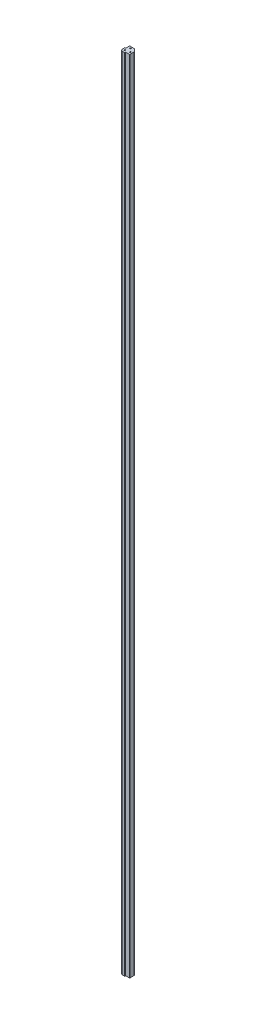
ISO-10303-21;
HEADER;
FILE_DESCRIPTION(('STEP AP214'),'2;1');
FILE_NAME('part.step','',(''),(''),'','','');
FILE_SCHEMA(('AUTOMOTIVE_DESIGN { 1 0 10303 214 1 1 1 1 }'));
ENDSEC;
DATA;
#1=APPLICATION_CONTEXT('core data for automotive mechanical design processes');
#2=APPLICATION_PROTOCOL_DEFINITION('international standard','automotive_design',2000,#1);
#3=PRODUCT_CONTEXT('',#1,'mechanical');
#4=PRODUCT('Part','Part','',(#3));
#5=PRODUCT_RELATED_PRODUCT_CATEGORY('part','',(#4));
#6=PRODUCT_DEFINITION_FORMATION('','',#4);
#7=PRODUCT_DEFINITION_CONTEXT('part definition',#1,'design');
#8=PRODUCT_DEFINITION('design','',#6,#7);
#9=PRODUCT_DEFINITION_SHAPE('','',#8);
#10=(LENGTH_UNIT() NAMED_UNIT(*) SI_UNIT(.MILLI.,.METRE.));
#11=(NAMED_UNIT(*) PLANE_ANGLE_UNIT() SI_UNIT($,.RADIAN.));
#12=(NAMED_UNIT(*) SI_UNIT($,.STERADIAN.) SOLID_ANGLE_UNIT());
#13=UNCERTAINTY_MEASURE_WITH_UNIT(LENGTH_MEASURE(1.E-05),#10,'distance_accuracy_value','');
#14=(GEOMETRIC_REPRESENTATION_CONTEXT(3) GLOBAL_UNCERTAINTY_ASSIGNED_CONTEXT((#13)) GLOBAL_UNIT_ASSIGNED_CONTEXT((#10,
#11,#12)) REPRESENTATION_CONTEXT('',''));
#15=CARTESIAN_POINT('',(0.,0.,0.));
#16=DIRECTION('',(0.,0.,1.));
#17=DIRECTION('',(1.,0.,0.));
#18=AXIS2_PLACEMENT_3D('',#15,#16,#17);
#19=CARTESIAN_POINT('',(4.57199999999998,1828.8,4.826));
#20=DIRECTION('',(0.,-1.,0.));
#21=DIRECTION('',(0.,0.,-1.));
#22=AXIS2_PLACEMENT_3D('',#19,#20,#21);
#23=CYLINDRICAL_SURFACE('',#22,0.254000000000002);
#24=CARTESIAN_POINT('',(4.57199999999998,0.,4.826));
#25=DIRECTION('',(0.,1.,0.));
#26=DIRECTION('',(0.,0.,-1.));
#27=AXIS2_PLACEMENT_3D('',#24,#25,#26);
#28=CIRCLE('',#27,0.254000000000002);
#29=CARTESIAN_POINT('',(4.57199999999998,0.,5.08));
#30=VERTEX_POINT('',#29);
#31=CARTESIAN_POINT('',(4.82599999999998,0.,4.826));
#32=VERTEX_POINT('',#31);
#33=EDGE_CURVE('E190',#30,#32,#28,.T.);
#34=ORIENTED_EDGE('',*,*,#33,.T.);
#35=DIRECTION('',(0.,-1.,0.));
#36=VECTOR('',#35,1.);
#37=CARTESIAN_POINT('',(4.82599999999998,1828.8,4.826));
#38=LINE('',#37,#36);
#39=CARTESIAN_POINT('',(4.82599999999998,1828.8,4.826));
#40=VERTEX_POINT('',#39);
#41=EDGE_CURVE('E11',#40,#32,#38,.T.);
#42=ORIENTED_EDGE('',*,*,#41,.F.);
#43=CARTESIAN_POINT('',(4.57199999999998,1828.8,4.826));
#44=DIRECTION('',(0.,1.,0.));
#45=DIRECTION('',(0.,0.,-1.));
#46=AXIS2_PLACEMENT_3D('',#43,#44,#45);
#47=CIRCLE('',#46,0.254000000000002);
#48=CARTESIAN_POINT('',(4.57199999999998,1828.8,5.08));
#49=VERTEX_POINT('',#48);
#50=EDGE_CURVE('E225',#49,#40,#47,.T.);
#51=ORIENTED_EDGE('',*,*,#50,.F.);
#52=DIRECTION('',(0.,-1.,0.));
#53=VECTOR('',#52,1.);
#54=CARTESIAN_POINT('',(4.57199999999998,1828.8,5.08));
#55=LINE('',#54,#53);
#56=EDGE_CURVE('E186',#49,#30,#55,.T.);
#57=ORIENTED_EDGE('',*,*,#56,.T.);
#58=EDGE_LOOP('',(#34,#42,#51,#57));
#59=FACE_BOUND('',#58,.T.);
#60=ADVANCED_FACE('F34',(#59),#23,.T.);
#61=CARTESIAN_POINT('',(4.82599999999998,1828.8,3.175));
#62=DIRECTION('',(-1.,0.,0.));
#63=DIRECTION('',(0.,0.,1.));
#64=AXIS2_PLACEMENT_3D('',#61,#62,#63);
#65=PLANE('',#64);
#66=DIRECTION('',(0.,0.,-1.));
#67=VECTOR('',#66,1.);
#68=CARTESIAN_POINT('',(4.82599999999998,0.,3.175));
#69=LINE('',#68,#67);
#70=CARTESIAN_POINT('',(4.82599999999998,0.,3.175));
#71=VERTEX_POINT('',#70);
#72=EDGE_CURVE('E193',#32,#71,#69,.T.);
#73=ORIENTED_EDGE('',*,*,#72,.T.);
#74=DIRECTION('',(0.,-1.,0.));
#75=VECTOR('',#74,1.);
#76=CARTESIAN_POINT('',(4.82599999999998,1828.8,3.175));
#77=LINE('',#76,#75);
#78=CARTESIAN_POINT('',(4.82599999999998,1828.8,3.175));
#79=VERTEX_POINT('',#78);
#80=EDGE_CURVE('E42',#79,#71,#77,.T.);
#81=ORIENTED_EDGE('',*,*,#80,.F.);
#82=DIRECTION('',(0.,0.,-1.));
#83=VECTOR('',#82,1.);
#84=CARTESIAN_POINT('',(4.82599999999998,1828.8,3.175));
#85=LINE('',#84,#83);
#86=EDGE_CURVE('E123',#40,#79,#85,.T.);
#87=ORIENTED_EDGE('',*,*,#86,.F.);
#88=ORIENTED_EDGE('',*,*,#41,.T.);
#89=EDGE_LOOP('',(#73,#81,#87,#88));
#90=FACE_BOUND('',#89,.T.);
#91=ADVANCED_FACE('F334',(#90),#65,.F.);
#92=CARTESIAN_POINT('',(4.95299999999998,1828.8,3.175));
#93=DIRECTION('',(0.,-1.,0.));
#94=DIRECTION('',(0.,0.,-1.));
#95=AXIS2_PLACEMENT_3D('',#92,#93,#94);
#96=CYLINDRICAL_SURFACE('',#95,0.127);
#97=CARTESIAN_POINT('',(4.95299999999998,0.,3.175));
#98=DIRECTION('',(0.,-1.,0.));
#99=DIRECTION('',(0.,0.,1.));
#100=AXIS2_PLACEMENT_3D('',#97,#98,#99);
#101=CIRCLE('',#100,0.127);
#102=CARTESIAN_POINT('',(4.95299999999998,0.,3.048));
#103=VERTEX_POINT('',#102);
#104=EDGE_CURVE('E196',#71,#103,#101,.T.);
#105=ORIENTED_EDGE('',*,*,#104,.T.);
#106=DIRECTION('',(0.,-1.,0.));
#107=VECTOR('',#106,1.);
#108=CARTESIAN_POINT('',(4.95299999999998,1828.8,3.048));
#109=LINE('',#108,#107);
#110=CARTESIAN_POINT('',(4.95299999999998,1828.8,3.048));
#111=VERTEX_POINT('',#110);
#112=EDGE_CURVE('E262',#111,#103,#109,.T.);
#113=ORIENTED_EDGE('',*,*,#112,.F.);
#114=CARTESIAN_POINT('',(4.95299999999998,1828.8,3.175));
#115=DIRECTION('',(0.,-1.,0.));
#116=DIRECTION('',(0.,0.,1.));
#117=AXIS2_PLACEMENT_3D('',#114,#115,#116);
#118=CIRCLE('',#117,0.127);
#119=EDGE_CURVE('E270',#79,#111,#118,.T.);
#120=ORIENTED_EDGE('',*,*,#119,.F.);
#121=ORIENTED_EDGE('',*,*,#80,.T.);
#122=EDGE_LOOP('',(#105,#113,#120,#121));
#123=FACE_BOUND('',#122,.T.);
#124=ADVANCED_FACE('F268',(#123),#96,.F.);
#125=CARTESIAN_POINT('',(13.208,1828.8,3.048));
#126=DIRECTION('',(0.,0.,-1.));
#127=DIRECTION('',(-1.,0.,0.));
#128=AXIS2_PLACEMENT_3D('',#125,#126,#127);
#129=PLANE('',#128);
#130=DIRECTION('',(1.,0.,0.));
#131=VECTOR('',#130,1.);
#132=CARTESIAN_POINT('',(13.208,0.,3.048));
#133=LINE('',#132,#131);
#134=CARTESIAN_POINT('',(13.208,0.,3.048));
#135=VERTEX_POINT('',#134);
#136=EDGE_CURVE('E198',#103,#135,#133,.T.);
#137=ORIENTED_EDGE('',*,*,#136,.T.);
#138=DIRECTION('',(0.,-1.,0.));
#139=VECTOR('',#138,1.);
#140=CARTESIAN_POINT('',(13.208,1828.8,3.048));
#141=LINE('',#140,#139);
#142=CARTESIAN_POINT('',(13.208,1828.8,3.048));
#143=VERTEX_POINT('',#142);
#144=EDGE_CURVE('E259',#143,#135,#141,.T.);
#145=ORIENTED_EDGE('',*,*,#144,.F.);
#146=DIRECTION('',(1.,0.,0.));
#147=VECTOR('',#146,1.);
#148=CARTESIAN_POINT('',(13.208,1828.8,3.048));
#149=LINE('',#148,#147);
#150=EDGE_CURVE('E288',#111,#143,#149,.T.);
#151=ORIENTED_EDGE('',*,*,#150,.F.);
#152=ORIENTED_EDGE('',*,*,#112,.T.);
#153=EDGE_LOOP('',(#137,#145,#151,#152));
#154=FACE_BOUND('',#153,.T.);
#155=ADVANCED_FACE('F279',(#154),#129,.F.);
#156=CARTESIAN_POINT('',(13.208,1828.8,2.286));
#157=DIRECTION('',(0.,-1.,0.));
#158=DIRECTION('',(0.,0.,-1.));
#159=AXIS2_PLACEMENT_3D('',#156,#157,#158);
#160=CYLINDRICAL_SURFACE('',#159,0.761999999999999);
#161=CARTESIAN_POINT('',(13.208,0.,2.286));
#162=DIRECTION('',(0.,1.,0.));
#163=DIRECTION('',(0.,0.,1.));
#164=AXIS2_PLACEMENT_3D('',#161,#162,#163);
#165=CIRCLE('',#164,0.761999999999999);
#166=CARTESIAN_POINT('',(13.97,0.,2.286));
#167=VERTEX_POINT('',#166);
#168=EDGE_CURVE('E200',#135,#167,#165,.T.);
#169=ORIENTED_EDGE('',*,*,#168,.T.);
#170=DIRECTION('',(0.,-1.,0.));
#171=VECTOR('',#170,1.);
#172=CARTESIAN_POINT('',(13.97,1828.8,2.286));
#173=LINE('',#172,#171);
#174=CARTESIAN_POINT('',(13.97,1828.8,2.286));
#175=VERTEX_POINT('',#174);
#176=EDGE_CURVE('E256',#175,#167,#173,.T.);
#177=ORIENTED_EDGE('',*,*,#176,.F.);
#178=CARTESIAN_POINT('',(13.208,1828.8,2.286));
#179=DIRECTION('',(0.,1.,0.));
#180=DIRECTION('',(0.,0.,1.));
#181=AXIS2_PLACEMENT_3D('',#178,#179,#180);
#182=CIRCLE('',#181,0.761999999999999);
#183=EDGE_CURVE('E285',#143,#175,#182,.T.);
#184=ORIENTED_EDGE('',*,*,#183,.F.);
#185=ORIENTED_EDGE('',*,*,#144,.T.);
#186=EDGE_LOOP('',(#169,#177,#184,#185));
#187=FACE_BOUND('',#186,.T.);
#188=ADVANCED_FACE('F283',(#187),#160,.T.);
#189=CARTESIAN_POINT('',(13.97,1828.8,2.286));
#190=DIRECTION('',(-1.,0.,0.));
#191=DIRECTION('',(0.,0.,1.));
#192=AXIS2_PLACEMENT_3D('',#189,#190,#191);
#193=PLANE('',#192);
#194=DIRECTION('',(0.,0.,-1.));
#195=VECTOR('',#194,1.);
#196=CARTESIAN_POINT('',(13.97,0.,2.286));
#197=LINE('',#196,#195);
#198=CARTESIAN_POINT('',(13.97,0.,-7.30436926547168));
#199=VERTEX_POINT('',#198);
#200=EDGE_CURVE('E202',#167,#199,#197,.T.);
#201=ORIENTED_EDGE('',*,*,#200,.T.);
#202=DIRECTION('',(0.,-1.,0.));
#203=VECTOR('',#202,1.);
#204=CARTESIAN_POINT('',(13.97,1828.8,-7.30436926547168));
#205=LINE('',#204,#203);
#206=CARTESIAN_POINT('',(13.97,1828.8,-7.30436926547168));
#207=VERTEX_POINT('',#206);
#208=EDGE_CURVE('E253',#207,#199,#205,.T.);
#209=ORIENTED_EDGE('',*,*,#208,.F.);
#210=DIRECTION('',(0.,0.,-1.));
#211=VECTOR('',#210,1.);
#212=CARTESIAN_POINT('',(13.97,1828.8,2.286));
#213=LINE('',#212,#211);
#214=EDGE_CURVE('E287',#175,#207,#213,.T.);
#215=ORIENTED_EDGE('',*,*,#214,.F.);
#216=ORIENTED_EDGE('',*,*,#176,.T.);
#217=EDGE_LOOP('',(#201,#209,#215,#216));
#218=FACE_BOUND('',#217,.T.);
#219=ADVANCED_FACE('F347',(#218),#193,.F.);
#220=CARTESIAN_POINT('',(13.208,1828.8,-7.30436926547168));
#221=DIRECTION('',(0.,-1.,0.));
#222=DIRECTION('',(0.,0.,-1.));
#223=AXIS2_PLACEMENT_3D('',#220,#221,#222);
#224=CYLINDRICAL_SURFACE('',#223,0.761999999999999);
#225=CARTESIAN_POINT('',(13.208,0.,-7.30436926547168));
#226=DIRECTION('',(0.,1.,0.));
#227=DIRECTION('',(0.,0.,-1.));
#228=AXIS2_PLACEMENT_3D('',#225,#226,#227);
#229=CIRCLE('',#228,0.761999999999999);
#230=CARTESIAN_POINT('',(13.7468153672641,0.,-7.84318463273583));
#231=VERTEX_POINT('',#230);
#232=EDGE_CURVE('E204',#199,#231,#229,.T.);
#233=ORIENTED_EDGE('',*,*,#232,.T.);
#234=DIRECTION('',(0.,-1.,0.));
#235=VECTOR('',#234,1.);
#236=CARTESIAN_POINT('',(13.7468153672641,1828.8,-7.84318463273583));
#237=LINE('',#236,#235);
#238=CARTESIAN_POINT('',(13.7468153672641,1828.8,-7.84318463273583));
#239=VERTEX_POINT('',#238);
#240=EDGE_CURVE('E250',#239,#231,#237,.T.);
#241=ORIENTED_EDGE('',*,*,#240,.F.);
#242=CARTESIAN_POINT('',(13.208,1828.8,-7.30436926547168));
#243=DIRECTION('',(0.,1.,0.));
#244=DIRECTION('',(0.,0.,-1.));
#245=AXIS2_PLACEMENT_3D('',#242,#243,#244);
#246=CIRCLE('',#245,0.761999999999999);
#247=EDGE_CURVE('E290',#207,#239,#246,.T.);
#248=ORIENTED_EDGE('',*,*,#247,.F.);
#249=ORIENTED_EDGE('',*,*,#208,.T.);
#250=EDGE_LOOP('',(#233,#241,#248,#249));
#251=FACE_BOUND('',#250,.T.);
#252=ADVANCED_FACE('F350',(#251),#224,.T.);
#253=CARTESIAN_POINT('',(7.84318463273583,1828.8,-13.7468153672641));
#254=DIRECTION('',(-0.707106781186549,0.,0.707106781186546));
#255=DIRECTION('',(0.707106781186546,0.,0.707106781186549));
#256=AXIS2_PLACEMENT_3D('',#253,#254,#255);
#257=PLANE('',#256);
#258=DIRECTION('',(-0.707106781186546,0.,-0.707106781186549));
#259=VECTOR('',#258,1.);
#260=CARTESIAN_POINT('',(7.84318463273583,0.,-13.7468153672641));
#261=LINE('',#260,#259);
#262=CARTESIAN_POINT('',(7.84318463273583,0.,-13.7468153672641));
#263=VERTEX_POINT('',#262);
#264=EDGE_CURVE('E206',#231,#263,#261,.T.);
#265=ORIENTED_EDGE('',*,*,#264,.T.);
#266=DIRECTION('',(0.,-1.,0.));
#267=VECTOR('',#266,1.);
#268=CARTESIAN_POINT('',(7.84318463273583,1828.8,-13.7468153672641));
#269=LINE('',#268,#267);
#270=CARTESIAN_POINT('',(7.84318463273583,1828.8,-13.7468153672641));
#271=VERTEX_POINT('',#270);
#272=EDGE_CURVE('E247',#271,#263,#269,.T.);
#273=ORIENTED_EDGE('',*,*,#272,.F.);
#274=DIRECTION('',(-0.707106781186546,0.,-0.707106781186549));
#275=VECTOR('',#274,1.);
#276=CARTESIAN_POINT('',(7.84318463273583,1828.8,-13.7468153672641));
#277=LINE('',#276,#275);
#278=EDGE_CURVE('E296',#239,#271,#277,.T.);
#279=ORIENTED_EDGE('',*,*,#278,.F.);
#280=ORIENTED_EDGE('',*,*,#240,.T.);
#281=EDGE_LOOP('',(#265,#273,#279,#280));
#282=FACE_BOUND('',#281,.T.);
#283=ADVANCED_FACE('F354',(#282),#257,.F.);
#284=CARTESIAN_POINT('',(7.30436926547168,1828.8,-13.208));
#285=DIRECTION('',(0.,-1.,0.));
#286=DIRECTION('',(0.,0.,-1.));
#287=AXIS2_PLACEMENT_3D('',#284,#285,#286);
#288=CYLINDRICAL_SURFACE('',#287,0.761999999999999);
#289=CARTESIAN_POINT('',(7.30436926547168,0.,-13.208));
#290=DIRECTION('',(0.,1.,0.));
#291=DIRECTION('',(0.,0.,1.));
#292=AXIS2_PLACEMENT_3D('',#289,#290,#291);
#293=CIRCLE('',#292,0.761999999999999);
#294=CARTESIAN_POINT('',(7.30436926547168,0.,-13.97));
#295=VERTEX_POINT('',#294);
#296=EDGE_CURVE('E208',#263,#295,#293,.T.);
#297=ORIENTED_EDGE('',*,*,#296,.T.);
#298=DIRECTION('',(0.,-1.,0.));
#299=VECTOR('',#298,1.);
#300=CARTESIAN_POINT('',(7.30436926547168,1828.8,-13.97));
#301=LINE('',#300,#299);
#302=CARTESIAN_POINT('',(7.30436926547168,1828.8,-13.97));
#303=VERTEX_POINT('',#302);
#304=EDGE_CURVE('E244',#303,#295,#301,.T.);
#305=ORIENTED_EDGE('',*,*,#304,.F.);
#306=CARTESIAN_POINT('',(7.30436926547168,1828.8,-13.208));
#307=DIRECTION('',(0.,1.,0.));
#308=DIRECTION('',(0.,0.,1.));
#309=AXIS2_PLACEMENT_3D('',#306,#307,#308);
#310=CIRCLE('',#309,0.761999999999999);
#311=EDGE_CURVE('E298',#271,#303,#310,.T.);
#312=ORIENTED_EDGE('',*,*,#311,.F.);
#313=ORIENTED_EDGE('',*,*,#272,.T.);
#314=EDGE_LOOP('',(#297,#305,#312,#313));
#315=FACE_BOUND('',#314,.T.);
#316=ADVANCED_FACE('F358',(#315),#288,.T.);
#317=CARTESIAN_POINT('',(-2.286,1828.8,-13.97));
#318=DIRECTION('',(0.,0.,1.));
#319=DIRECTION('',(1.,0.,0.));
#320=AXIS2_PLACEMENT_3D('',#317,#318,#319);
#321=PLANE('',#320);
#322=DIRECTION('',(-1.,0.,0.));
#323=VECTOR('',#322,1.);
#324=CARTESIAN_POINT('',(-2.286,0.,-13.97));
#325=LINE('',#324,#323);
#326=CARTESIAN_POINT('',(-2.286,0.,-13.97));
#327=VERTEX_POINT('',#326);
#328=EDGE_CURVE('E210',#295,#327,#325,.T.);
#329=ORIENTED_EDGE('',*,*,#328,.T.);
#330=DIRECTION('',(0.,-1.,0.));
#331=VECTOR('',#330,1.);
#332=CARTESIAN_POINT('',(-2.286,1828.8,-13.97));
#333=LINE('',#332,#331);
#334=CARTESIAN_POINT('',(-2.286,1828.8,-13.97));
#335=VERTEX_POINT('',#334);
#336=EDGE_CURVE('E241',#335,#327,#333,.T.);
#337=ORIENTED_EDGE('',*,*,#336,.F.);
#338=DIRECTION('',(-1.,0.,0.));
#339=VECTOR('',#338,1.);
#340=CARTESIAN_POINT('',(-2.286,1828.8,-13.97));
#341=LINE('',#340,#339);
#342=EDGE_CURVE('E300',#303,#335,#341,.T.);
#343=ORIENTED_EDGE('',*,*,#342,.F.);
#344=ORIENTED_EDGE('',*,*,#304,.T.);
#345=EDGE_LOOP('',(#329,#337,#343,#344));
#346=FACE_BOUND('',#345,.T.);
#347=ADVANCED_FACE('F362',(#346),#321,.F.);
#348=CARTESIAN_POINT('',(-2.286,1828.8,-13.208));
#349=DIRECTION('',(0.,-1.,0.));
#350=DIRECTION('',(0.,0.,-1.));
#351=AXIS2_PLACEMENT_3D('',#348,#349,#350);
#352=CYLINDRICAL_SURFACE('',#351,0.761999999999999);
#353=CARTESIAN_POINT('',(-2.286,0.,-13.208));
#354=DIRECTION('',(0.,1.,0.));
#355=DIRECTION('',(0.,0.,-1.));
#356=AXIS2_PLACEMENT_3D('',#353,#354,#355);
#357=CIRCLE('',#356,0.761999999999999);
#358=CARTESIAN_POINT('',(-3.048,0.,-13.208));
#359=VERTEX_POINT('',#358);
#360=EDGE_CURVE('E212',#327,#359,#357,.T.);
#361=ORIENTED_EDGE('',*,*,#360,.T.);
#362=DIRECTION('',(0.,-1.,0.));
#363=VECTOR('',#362,1.);
#364=CARTESIAN_POINT('',(-3.048,1828.8,-13.208));
#365=LINE('',#364,#363);
#366=CARTESIAN_POINT('',(-3.048,1828.8,-13.208));
#367=VERTEX_POINT('',#366);
#368=EDGE_CURVE('E238',#367,#359,#365,.T.);
#369=ORIENTED_EDGE('',*,*,#368,.F.);
#370=CARTESIAN_POINT('',(-2.286,1828.8,-13.208));
#371=DIRECTION('',(0.,1.,0.));
#372=DIRECTION('',(0.,0.,-1.));
#373=AXIS2_PLACEMENT_3D('',#370,#371,#372);
#374=CIRCLE('',#373,0.761999999999999);
#375=EDGE_CURVE('E302',#335,#367,#374,.T.);
#376=ORIENTED_EDGE('',*,*,#375,.F.);
#377=ORIENTED_EDGE('',*,*,#336,.T.);
#378=EDGE_LOOP('',(#361,#369,#376,#377));
#379=FACE_BOUND('',#378,.T.);
#380=ADVANCED_FACE('F366',(#379),#352,.T.);
#381=CARTESIAN_POINT('',(-3.048,1828.8,-13.208));
#382=DIRECTION('',(1.,0.,0.));
#383=DIRECTION('',(0.,0.,-1.));
#384=AXIS2_PLACEMENT_3D('',#381,#382,#383);
#385=PLANE('',#384);
#386=DIRECTION('',(0.,0.,1.));
#387=VECTOR('',#386,1.);
#388=CARTESIAN_POINT('',(-3.048,0.,-13.208));
#389=LINE('',#388,#387);
#390=CARTESIAN_POINT('',(-3.048,0.,-4.953));
#391=VERTEX_POINT('',#390);
#392=EDGE_CURVE('E214',#359,#391,#389,.T.);
#393=ORIENTED_EDGE('',*,*,#392,.T.);
#394=DIRECTION('',(0.,-1.,0.));
#395=VECTOR('',#394,1.);
#396=CARTESIAN_POINT('',(-3.048,1828.8,-4.953));
#397=LINE('',#396,#395);
#398=CARTESIAN_POINT('',(-3.048,1828.8,-4.953));
#399=VERTEX_POINT('',#398);
#400=EDGE_CURVE('E235',#399,#391,#397,.T.);
#401=ORIENTED_EDGE('',*,*,#400,.F.);
#402=DIRECTION('',(0.,0.,1.));
#403=VECTOR('',#402,1.);
#404=CARTESIAN_POINT('',(-3.048,1828.8,-13.208));
#405=LINE('',#404,#403);
#406=EDGE_CURVE('E304',#367,#399,#405,.T.);
#407=ORIENTED_EDGE('',*,*,#406,.F.);
#408=ORIENTED_EDGE('',*,*,#368,.T.);
#409=EDGE_LOOP('',(#393,#401,#407,#408));
#410=FACE_BOUND('',#409,.T.);
#411=ADVANCED_FACE('F370',(#410),#385,.F.);
#412=CARTESIAN_POINT('',(-3.175,1828.8,-4.953));
#413=DIRECTION('',(0.,-1.,0.));
#414=DIRECTION('',(0.,0.,-1.));
#415=AXIS2_PLACEMENT_3D('',#412,#413,#414);
#416=CYLINDRICAL_SURFACE('',#415,0.127);
#417=CARTESIAN_POINT('',(-3.175,0.,-4.953));
#418=DIRECTION('',(0.,-1.,0.));
#419=DIRECTION('',(0.,0.,-1.));
#420=AXIS2_PLACEMENT_3D('',#417,#418,#419);
#421=CIRCLE('',#420,0.127);
#422=CARTESIAN_POINT('',(-3.175,0.,-4.826));
#423=VERTEX_POINT('',#422);
#424=EDGE_CURVE('E216',#391,#423,#421,.T.);
#425=ORIENTED_EDGE('',*,*,#424,.T.);
#426=DIRECTION('',(0.,-1.,0.));
#427=VECTOR('',#426,1.);
#428=CARTESIAN_POINT('',(-3.175,1828.8,-4.826));
#429=LINE('',#428,#427);
#430=CARTESIAN_POINT('',(-3.175,1828.8,-4.826));
#431=VERTEX_POINT('',#430);
#432=EDGE_CURVE('E232',#431,#423,#429,.T.);
#433=ORIENTED_EDGE('',*,*,#432,.F.);
#434=CARTESIAN_POINT('',(-3.175,1828.8,-4.953));
#435=DIRECTION('',(0.,-1.,0.));
#436=DIRECTION('',(0.,0.,-1.));
#437=AXIS2_PLACEMENT_3D('',#434,#435,#436);
#438=CIRCLE('',#437,0.127);
#439=EDGE_CURVE('E306',#399,#431,#438,.T.);
#440=ORIENTED_EDGE('',*,*,#439,.F.);
#441=ORIENTED_EDGE('',*,*,#400,.T.);
#442=EDGE_LOOP('',(#425,#433,#440,#441));
#443=FACE_BOUND('',#442,.T.);
#444=ADVANCED_FACE('F374',(#443),#416,.F.);
#445=CARTESIAN_POINT('',(-3.175,1828.8,-4.826));
#446=DIRECTION('',(0.,0.,1.));
#447=DIRECTION('',(1.,0.,0.));
#448=AXIS2_PLACEMENT_3D('',#445,#446,#447);
#449=PLANE('',#448);
#450=DIRECTION('',(-1.,0.,0.));
#451=VECTOR('',#450,1.);
#452=CARTESIAN_POINT('',(-3.175,0.,-4.826));
#453=LINE('',#452,#451);
#454=CARTESIAN_POINT('',(-4.826,0.,-4.826));
#455=VERTEX_POINT('',#454);
#456=EDGE_CURVE('E218',#423,#455,#453,.T.);
#457=ORIENTED_EDGE('',*,*,#456,.T.);
#458=DIRECTION('',(0.,-1.,0.));
#459=VECTOR('',#458,1.);
#460=CARTESIAN_POINT('',(-4.826,1828.8,-4.826));
#461=LINE('',#460,#459);
#462=CARTESIAN_POINT('',(-4.826,1828.8,-4.826));
#463=VERTEX_POINT('',#462);
#464=EDGE_CURVE('E229',#463,#455,#461,.T.);
#465=ORIENTED_EDGE('',*,*,#464,.F.);
#466=DIRECTION('',(-1.,0.,0.));
#467=VECTOR('',#466,1.);
#468=CARTESIAN_POINT('',(-3.175,1828.8,-4.826));
#469=LINE('',#468,#467);
#470=EDGE_CURVE('E308',#431,#463,#469,.T.);
#471=ORIENTED_EDGE('',*,*,#470,.F.);
#472=ORIENTED_EDGE('',*,*,#432,.T.);
#473=EDGE_LOOP('',(#457,#465,#471,#472));
#474=FACE_BOUND('',#473,.T.);
#475=ADVANCED_FACE('F314',(#474),#449,.F.);
#476=CARTESIAN_POINT('',(-4.826,1828.8,-4.572));
#477=DIRECTION('',(0.,-1.,0.));
#478=DIRECTION('',(0.,0.,-1.));
#479=AXIS2_PLACEMENT_3D('',#476,#477,#478);
#480=CYLINDRICAL_SURFACE('',#479,0.254);
#481=CARTESIAN_POINT('',(-4.826,0.,-4.572));
#482=DIRECTION('',(0.,1.,0.));
#483=DIRECTION('',(0.,0.,1.));
#484=AXIS2_PLACEMENT_3D('',#481,#482,#483);
#485=CIRCLE('',#484,0.254);
#486=CARTESIAN_POINT('',(-5.08,0.,-4.572));
#487=VERTEX_POINT('',#486);
#488=EDGE_CURVE('E220',#455,#487,#485,.T.);
#489=ORIENTED_EDGE('',*,*,#488,.T.);
#490=DIRECTION('',(0.,-1.,0.));
#491=VECTOR('',#490,1.);
#492=CARTESIAN_POINT('',(-5.08,1828.8,-4.572));
#493=LINE('',#492,#491);
#494=CARTESIAN_POINT('',(-5.08,1828.8,-4.572));
#495=VERTEX_POINT('',#494);
#496=EDGE_CURVE('E181',#495,#487,#493,.T.);
#497=ORIENTED_EDGE('',*,*,#496,.F.);
#498=CARTESIAN_POINT('',(-4.826,1828.8,-4.572));
#499=DIRECTION('',(0.,1.,0.));
#500=DIRECTION('',(0.,0.,1.));
#501=AXIS2_PLACEMENT_3D('',#498,#499,#500);
#502=CIRCLE('',#501,0.254);
#503=EDGE_CURVE('E172',#463,#495,#502,.T.);
#504=ORIENTED_EDGE('',*,*,#503,.F.);
#505=ORIENTED_EDGE('',*,*,#464,.T.);
#506=EDGE_LOOP('',(#489,#497,#504,#505));
#507=FACE_BOUND('',#506,.T.);
#508=ADVANCED_FACE('F318',(#507),#480,.T.);
#509=CARTESIAN_POINT('',(-5.08,1828.8,0.));
#510=DIRECTION('',(1.,0.,0.));
#511=DIRECTION('',(0.,0.,-1.));
#512=AXIS2_PLACEMENT_3D('',#509,#510,#511);
#513=PLANE('',#512);
#514=DIRECTION('',(0.,0.,1.));
#515=VECTOR('',#514,1.);
#516=CARTESIAN_POINT('',(-5.08,0.,0.));
#517=LINE('',#516,#515);
#518=CARTESIAN_POINT('',(-5.08,0.,0.));
#519=VERTEX_POINT('',#518);
#520=EDGE_CURVE('E180',#487,#519,#517,.T.);
#521=ORIENTED_EDGE('',*,*,#520,.T.);
#522=DIRECTION('',(0.,-1.,0.));
#523=VECTOR('',#522,1.);
#524=CARTESIAN_POINT('',(-5.08,1828.8,0.));
#525=LINE('',#524,#523);
#526=CARTESIAN_POINT('',(-5.08,1828.8,0.));
#527=VERTEX_POINT('',#526);
#528=EDGE_CURVE('E177',#527,#519,#525,.T.);
#529=ORIENTED_EDGE('',*,*,#528,.F.);
#530=DIRECTION('',(0.,0.,1.));
#531=VECTOR('',#530,1.);
#532=CARTESIAN_POINT('',(-5.08,1828.8,0.));
#533=LINE('',#532,#531);
#534=EDGE_CURVE('E166',#495,#527,#533,.T.);
#535=ORIENTED_EDGE('',*,*,#534,.F.);
#536=ORIENTED_EDGE('',*,*,#496,.T.);
#537=EDGE_LOOP('',(#521,#529,#535,#536));
#538=FACE_BOUND('',#537,.T.);
#539=ADVANCED_FACE('F178',(#538),#513,.F.);
#540=CARTESIAN_POINT('',(0.,1828.8,0.));
#541=DIRECTION('',(0.,-1.,0.));
#542=DIRECTION('',(0.,0.,-1.));
#543=AXIS2_PLACEMENT_3D('',#540,#541,#542);
#544=CYLINDRICAL_SURFACE('',#543,5.08);
#545=CARTESIAN_POINT('',(0.,0.,0.));
#546=DIRECTION('',(0.,1.,0.));
#547=DIRECTION('',(0.,0.,-1.));
#548=AXIS2_PLACEMENT_3D('',#545,#546,#547);
#549=CIRCLE('',#548,5.08);
#550=CARTESIAN_POINT('',(0.,0.,5.08));
#551=VERTEX_POINT('',#550);
#552=EDGE_CURVE('E109',#519,#551,#549,.T.);
#553=ORIENTED_EDGE('',*,*,#552,.T.);
#554=DIRECTION('',(0.,-1.,0.));
#555=VECTOR('',#554,1.);
#556=CARTESIAN_POINT('',(0.,1828.8,5.08));
#557=LINE('',#556,#555);
#558=CARTESIAN_POINT('',(0.,1828.8,5.08));
#559=VERTEX_POINT('',#558);
#560=EDGE_CURVE('E182',#559,#551,#557,.T.);
#561=ORIENTED_EDGE('',*,*,#560,.F.);
#562=CARTESIAN_POINT('',(0.,1828.8,0.));
#563=DIRECTION('',(0.,1.,0.));
#564=DIRECTION('',(0.,0.,-1.));
#565=AXIS2_PLACEMENT_3D('',#562,#563,#564);
#566=CIRCLE('',#565,5.08);
#567=EDGE_CURVE('E170',#527,#559,#566,.T.);
#568=ORIENTED_EDGE('',*,*,#567,.F.);
#569=ORIENTED_EDGE('',*,*,#528,.T.);
#570=EDGE_LOOP('',(#553,#561,#568,#569));
#571=FACE_BOUND('',#570,.T.);
#572=ADVANCED_FACE('F184',(#571),#544,.T.);
#573=CARTESIAN_POINT('',(0.,1828.8,5.08));
#574=DIRECTION('',(0.,0.,-1.));
#575=DIRECTION('',(-1.,0.,0.));
#576=AXIS2_PLACEMENT_3D('',#573,#574,#575);
#577=PLANE('',#576);
#578=DIRECTION('',(1.,0.,0.));
#579=VECTOR('',#578,1.);
#580=CARTESIAN_POINT('',(0.,0.,5.08));
#581=LINE('',#580,#579);
#582=EDGE_CURVE('E115',#551,#30,#581,.T.);
#583=ORIENTED_EDGE('',*,*,#582,.T.);
#584=ORIENTED_EDGE('',*,*,#56,.F.);
#585=DIRECTION('',(1.,0.,0.));
#586=VECTOR('',#585,1.);
#587=CARTESIAN_POINT('',(0.,1828.8,5.08));
#588=LINE('',#587,#586);
#589=EDGE_CURVE('E50',#559,#49,#588,.T.);
#590=ORIENTED_EDGE('',*,*,#589,.F.);
#591=ORIENTED_EDGE('',*,*,#560,.T.);
#592=EDGE_LOOP('',(#583,#584,#590,#591));
#593=FACE_BOUND('',#592,.T.);
#594=ADVANCED_FACE('F322',(#593),#577,.F.);
#595=CARTESIAN_POINT('',(4.57199999999998,1828.8,4.826));
#596=DIRECTION('',(0.,-1.,0.));
#597=DIRECTION('',(0.,0.,-1.));
#598=AXIS2_PLACEMENT_3D('',#595,#596,#597);
#599=PLANE('',#598);
#600=CARTESIAN_POINT('',(0.,1828.8,0.));
#601=DIRECTION('',(0.,1.,0.));
#602=DIRECTION('',(0.,0.,1.));
#603=AXIS2_PLACEMENT_3D('',#600,#601,#602);
#604=CIRCLE('',#603,1.39699999999977);
#605=CARTESIAN_POINT('',(0.,1828.8,1.39699999999977));
#606=VERTEX_POINT('',#605);
#607=EDGE_CURVE('E450',#606,#606,#604,.T.);
#608=ORIENTED_EDGE('',*,*,#607,.F.);
#609=EDGE_LOOP('',(#608));
#610=FACE_BOUND('',#609,.T.);
#611=CARTESIAN_POINT('',(2.54,1828.8,-10.16));
#612=DIRECTION('',(0.,1.,0.));
#613=DIRECTION('',(0.,0.,1.));
#614=AXIS2_PLACEMENT_3D('',#611,#612,#613);
#615=CIRCLE('',#614,1.39699999999977);
#616=CARTESIAN_POINT('',(2.54,1828.8,-8.76300000000023));
#617=VERTEX_POINT('',#616);
#618=EDGE_CURVE('E452',#617,#617,#615,.T.);
#619=ORIENTED_EDGE('',*,*,#618,.F.);
#620=EDGE_LOOP('',(#619));
#621=FACE_BOUND('',#620,.T.);
#622=CARTESIAN_POINT('',(10.16,1828.8,-2.54));
#623=DIRECTION('',(0.,1.,0.));
#624=DIRECTION('',(0.,0.,1.));
#625=AXIS2_PLACEMENT_3D('',#622,#623,#624);
#626=CIRCLE('',#625,1.39699999999978);
#627=CARTESIAN_POINT('',(10.16,1828.8,-1.14300000000023));
#628=VERTEX_POINT('',#627);
#629=EDGE_CURVE('E460',#628,#628,#626,.T.);
#630=ORIENTED_EDGE('',*,*,#629,.F.);
#631=EDGE_LOOP('',(#630));
#632=FACE_BOUND('',#631,.T.);
#633=ORIENTED_EDGE('',*,*,#50,.T.);
#634=ORIENTED_EDGE('',*,*,#86,.T.);
#635=ORIENTED_EDGE('',*,*,#119,.T.);
#636=ORIENTED_EDGE('',*,*,#150,.T.);
#637=ORIENTED_EDGE('',*,*,#183,.T.);
#638=ORIENTED_EDGE('',*,*,#214,.T.);
#639=ORIENTED_EDGE('',*,*,#247,.T.);
#640=ORIENTED_EDGE('',*,*,#278,.T.);
#641=ORIENTED_EDGE('',*,*,#311,.T.);
#642=ORIENTED_EDGE('',*,*,#342,.T.);
#643=ORIENTED_EDGE('',*,*,#375,.T.);
#644=ORIENTED_EDGE('',*,*,#406,.T.);
#645=ORIENTED_EDGE('',*,*,#439,.T.);
#646=ORIENTED_EDGE('',*,*,#470,.T.);
#647=ORIENTED_EDGE('',*,*,#503,.T.);
#648=ORIENTED_EDGE('',*,*,#534,.T.);
#649=ORIENTED_EDGE('',*,*,#567,.T.);
#650=ORIENTED_EDGE('',*,*,#589,.T.);
#651=EDGE_LOOP('',(#633,#634,#635,#636,#637,#638,#639,#640,#641,#642,#643,#644,#645,#646,#647,
#648,#649,#650));
#652=FACE_BOUND('',#651,.T.);
#653=ADVANCED_FACE('F168',(#610,#621,#632,#652),#599,.F.);
#654=CARTESIAN_POINT('',(4.57199999999998,0.,4.826));
#655=DIRECTION('',(0.,-1.,0.));
#656=DIRECTION('',(0.,0.,-1.));
#657=AXIS2_PLACEMENT_3D('',#654,#655,#656);
#658=PLANE('',#657);
#659=CARTESIAN_POINT('',(0.,0.,0.));
#660=DIRECTION('',(0.,1.,0.));
#661=DIRECTION('',(0.,0.,1.));
#662=AXIS2_PLACEMENT_3D('',#659,#660,#661);
#663=CIRCLE('',#662,1.39699999999955);
#664=CARTESIAN_POINT('',(0.,0.,1.39699999999955));
#665=VERTEX_POINT('',#664);
#666=EDGE_CURVE('E447',#665,#665,#663,.T.);
#667=ORIENTED_EDGE('',*,*,#666,.T.);
#668=EDGE_LOOP('',(#667));
#669=FACE_BOUND('',#668,.T.);
#670=CARTESIAN_POINT('',(2.54,0.,-10.16));
#671=DIRECTION('',(0.,1.,0.));
#672=DIRECTION('',(0.,0.,1.));
#673=AXIS2_PLACEMENT_3D('',#670,#671,#672);
#674=CIRCLE('',#673,1.39699999999955);
#675=CARTESIAN_POINT('',(2.54,0.,-8.76300000000045));
#676=VERTEX_POINT('',#675);
#677=EDGE_CURVE('E457',#676,#676,#674,.T.);
#678=ORIENTED_EDGE('',*,*,#677,.T.);
#679=EDGE_LOOP('',(#678));
#680=FACE_BOUND('',#679,.T.);
#681=CARTESIAN_POINT('',(10.16,0.,-2.54));
#682=DIRECTION('',(0.,1.,0.));
#683=DIRECTION('',(0.,0.,1.));
#684=AXIS2_PLACEMENT_3D('',#681,#682,#683);
#685=CIRCLE('',#684,1.39699999999955);
#686=CARTESIAN_POINT('',(10.16,0.,-1.14300000000045));
#687=VERTEX_POINT('',#686);
#688=EDGE_CURVE('E194',#687,#687,#685,.T.);
#689=ORIENTED_EDGE('',*,*,#688,.T.);
#690=EDGE_LOOP('',(#689));
#691=FACE_BOUND('',#690,.T.);
#692=ORIENTED_EDGE('',*,*,#33,.F.);
#693=ORIENTED_EDGE('',*,*,#582,.F.);
#694=ORIENTED_EDGE('',*,*,#552,.F.);
#695=ORIENTED_EDGE('',*,*,#520,.F.);
#696=ORIENTED_EDGE('',*,*,#488,.F.);
#697=ORIENTED_EDGE('',*,*,#456,.F.);
#698=ORIENTED_EDGE('',*,*,#424,.F.);
#699=ORIENTED_EDGE('',*,*,#392,.F.);
#700=ORIENTED_EDGE('',*,*,#360,.F.);
#701=ORIENTED_EDGE('',*,*,#328,.F.);
#702=ORIENTED_EDGE('',*,*,#296,.F.);
#703=ORIENTED_EDGE('',*,*,#264,.F.);
#704=ORIENTED_EDGE('',*,*,#232,.F.);
#705=ORIENTED_EDGE('',*,*,#200,.F.);
#706=ORIENTED_EDGE('',*,*,#168,.F.);
#707=ORIENTED_EDGE('',*,*,#136,.F.);
#708=ORIENTED_EDGE('',*,*,#104,.F.);
#709=ORIENTED_EDGE('',*,*,#72,.F.);
#710=EDGE_LOOP('',(#692,#693,#694,#695,#696,#697,#698,#699,#700,#701,#702,#703,#704,#705,#706,
#707,#708,#709));
#711=FACE_BOUND('',#710,.T.);
#712=ADVANCED_FACE('F274',(#669,#680,#691,#711),#658,.T.);
#713=CARTESIAN_POINT('',(10.16,1828.8,-2.54));
#714=DIRECTION('',(0.,1.,0.));
#715=DIRECTION('',(0.,0.,1.));
#716=AXIS2_PLACEMENT_3D('',#713,#714,#715);
#717=CYLINDRICAL_SURFACE('',#716,1.39699999999966);
#718=ORIENTED_EDGE('',*,*,#688,.F.);
#719=EDGE_LOOP('',(#718));
#720=FACE_BOUND('',#719,.T.);
#721=ORIENTED_EDGE('',*,*,#629,.T.);
#722=EDGE_LOOP('',(#721));
#723=FACE_BOUND('',#722,.T.);
#724=ADVANCED_FACE('F411',(#720,#723),#717,.F.);
#725=CARTESIAN_POINT('',(2.54,1828.8,-10.16));
#726=DIRECTION('',(0.,1.,0.));
#727=DIRECTION('',(0.,0.,1.));
#728=AXIS2_PLACEMENT_3D('',#725,#726,#727);
#729=CYLINDRICAL_SURFACE('',#728,1.39699999999966);
#730=ORIENTED_EDGE('',*,*,#677,.F.);
#731=EDGE_LOOP('',(#730));
#732=FACE_BOUND('',#731,.T.);
#733=ORIENTED_EDGE('',*,*,#618,.T.);
#734=EDGE_LOOP('',(#733));
#735=FACE_BOUND('',#734,.T.);
#736=ADVANCED_FACE('F420',(#732,#735),#729,.F.);
#737=CARTESIAN_POINT('',(0.,1828.8,0.));
#738=DIRECTION('',(0.,1.,0.));
#739=DIRECTION('',(0.,0.,1.));
#740=AXIS2_PLACEMENT_3D('',#737,#738,#739);
#741=CYLINDRICAL_SURFACE('',#740,1.39699999999966);
#742=ORIENTED_EDGE('',*,*,#666,.F.);
#743=EDGE_LOOP('',(#742));
#744=FACE_BOUND('',#743,.T.);
#745=ORIENTED_EDGE('',*,*,#607,.T.);
#746=EDGE_LOOP('',(#745));
#747=FACE_BOUND('',#746,.T.);
#748=ADVANCED_FACE('F430',(#744,#747),#741,.F.);
#749=CLOSED_SHELL('',(#60,#91,#124,#155,#188,#219,#252,#283,#316,#347,#380,#411,#444,#475,#508,
#539,#572,#594,#653,#712,#724,#736,#748));
#750=MANIFOLD_SOLID_BREP('B2',#749);
#751=ADVANCED_BREP_SHAPE_REPRESENTATION('',(#18,#750),#14);
#752=SHAPE_DEFINITION_REPRESENTATION(#9,#751);
ENDSEC;
END-ISO-10303-21;
